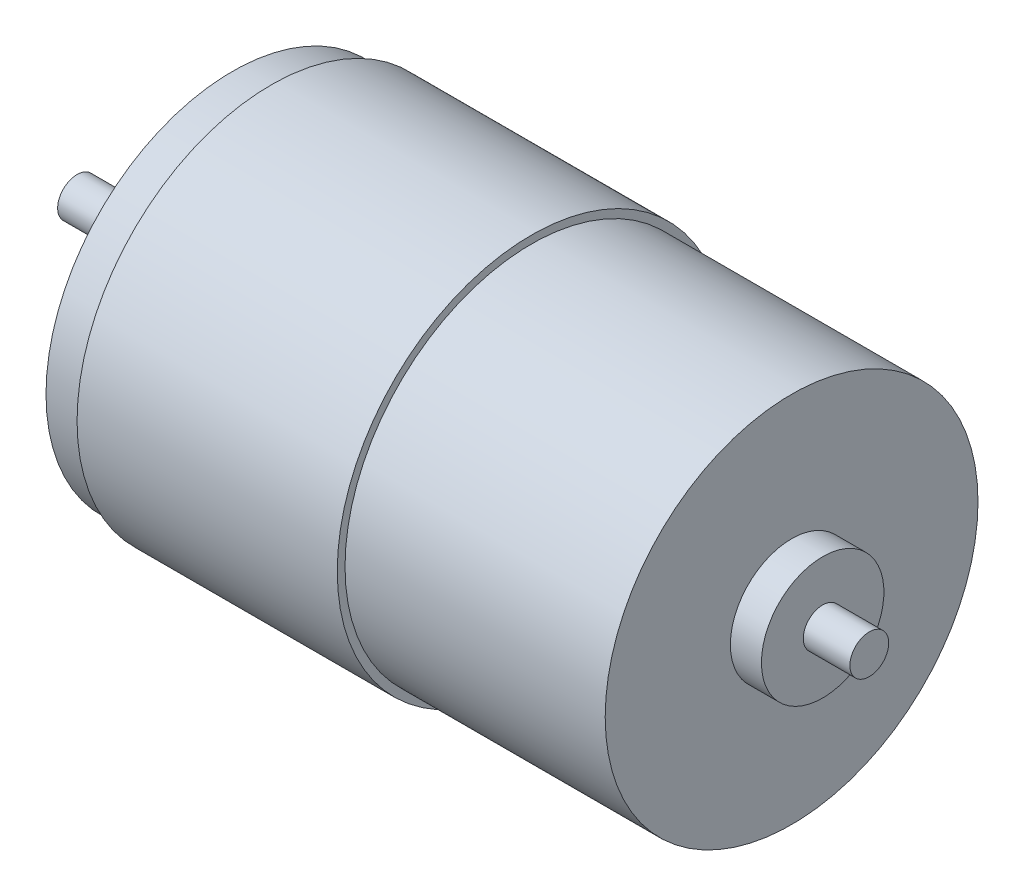
ISO-10303-21;
HEADER;
FILE_DESCRIPTION(('STEP AP214'),'2;1');
FILE_NAME('part.step','',(''),(''),'','','');
FILE_SCHEMA(('AUTOMOTIVE_DESIGN { 1 0 10303 214 1 1 1 1 }'));
ENDSEC;
DATA;
#1=APPLICATION_CONTEXT('core data for automotive mechanical design processes');
#2=APPLICATION_PROTOCOL_DEFINITION('international standard','automotive_design',2000,#1);
#3=PRODUCT_CONTEXT('',#1,'mechanical');
#4=PRODUCT('Part','Part','',(#3));
#5=PRODUCT_RELATED_PRODUCT_CATEGORY('part','',(#4));
#6=PRODUCT_DEFINITION_FORMATION('','',#4);
#7=PRODUCT_DEFINITION_CONTEXT('part definition',#1,'design');
#8=PRODUCT_DEFINITION('design','',#6,#7);
#9=PRODUCT_DEFINITION_SHAPE('','',#8);
#10=(LENGTH_UNIT() NAMED_UNIT(*) SI_UNIT(.MILLI.,.METRE.));
#11=(NAMED_UNIT(*) PLANE_ANGLE_UNIT() SI_UNIT($,.RADIAN.));
#12=(NAMED_UNIT(*) SI_UNIT($,.STERADIAN.) SOLID_ANGLE_UNIT());
#13=UNCERTAINTY_MEASURE_WITH_UNIT(LENGTH_MEASURE(1.E-05),#10,'distance_accuracy_value','');
#14=(GEOMETRIC_REPRESENTATION_CONTEXT(3) GLOBAL_UNCERTAINTY_ASSIGNED_CONTEXT((#13)) GLOBAL_UNIT_ASSIGNED_CONTEXT((#10,
#11,#12)) REPRESENTATION_CONTEXT('',''));
#15=CARTESIAN_POINT('',(0.,0.,0.));
#16=DIRECTION('',(0.,0.,1.));
#17=DIRECTION('',(1.,0.,0.));
#18=AXIS2_PLACEMENT_3D('',#15,#16,#17);
#19=CARTESIAN_POINT('',(-8.12353797841613,0.,0.));
#20=DIRECTION('',(-1.,0.,0.));
#21=DIRECTION('',(0.,0.,1.));
#22=AXIS2_PLACEMENT_3D('',#19,#20,#21);
#23=CYLINDRICAL_SURFACE('',#22,7.88455590960946);
#24=CARTESIAN_POINT('',(89.256074307646,0.,0.));
#25=DIRECTION('',(-1.,0.,0.));
#26=DIRECTION('',(0.,0.,1.));
#27=AXIS2_PLACEMENT_3D('',#24,#25,#26);
#28=CIRCLE('',#27,7.88455590960946);
#29=CARTESIAN_POINT('',(89.256074307646,0.,7.88455590960946));
#30=VERTEX_POINT('',#29);
#31=EDGE_CURVE('E82',#30,#30,#28,.T.);
#32=ORIENTED_EDGE('',*,*,#31,.T.);
#33=EDGE_LOOP('',(#32));
#34=FACE_BOUND('',#33,.T.);
#35=CARTESIAN_POINT('',(85.2560743076459,0.,0.));
#36=DIRECTION('',(-1.,0.,0.));
#37=DIRECTION('',(0.,0.,1.));
#38=AXIS2_PLACEMENT_3D('',#35,#36,#37);
#39=CIRCLE('',#38,7.88455590960946);
#40=CARTESIAN_POINT('',(85.2560743076459,0.,7.88455590960946));
#41=VERTEX_POINT('',#40);
#42=EDGE_CURVE('E10',#41,#41,#39,.T.);
#43=ORIENTED_EDGE('',*,*,#42,.F.);
#44=EDGE_LOOP('',(#43));
#45=FACE_BOUND('',#44,.T.);
#46=ADVANCED_FACE('F36',(#34,#45),#23,.T.);
#47=CARTESIAN_POINT('',(85.2560743076459,0.,0.));
#48=DIRECTION('',(1.,0.,0.));
#49=DIRECTION('',(0.,0.,-1.));
#50=AXIS2_PLACEMENT_3D('',#47,#48,#49);
#51=PLANE('',#50);
#52=ORIENTED_EDGE('',*,*,#42,.T.);
#53=EDGE_LOOP('',(#52));
#54=FACE_BOUND('',#53,.T.);
#55=CARTESIAN_POINT('',(85.2560743076459,0.,0.));
#56=DIRECTION('',(-1.,0.,0.));
#57=DIRECTION('',(0.,0.,1.));
#58=AXIS2_PLACEMENT_3D('',#55,#56,#57);
#59=CIRCLE('',#58,24.);
#60=CARTESIAN_POINT('',(85.2560743076459,0.,24.));
#61=VERTEX_POINT('',#60);
#62=EDGE_CURVE('E42',#61,#61,#59,.T.);
#63=ORIENTED_EDGE('',*,*,#62,.F.);
#64=EDGE_LOOP('',(#63));
#65=FACE_BOUND('',#64,.T.);
#66=ADVANCED_FACE('F146',(#54,#65),#51,.T.);
#67=CARTESIAN_POINT('',(-8.12353797841613,0.,0.));
#68=DIRECTION('',(-1.,0.,0.));
#69=DIRECTION('',(0.,0.,1.));
#70=AXIS2_PLACEMENT_3D('',#67,#68,#69);
#71=CYLINDRICAL_SURFACE('',#70,24.);
#72=ORIENTED_EDGE('',*,*,#62,.T.);
#73=EDGE_LOOP('',(#72));
#74=FACE_BOUND('',#73,.T.);
#75=CARTESIAN_POINT('',(51.7560743076459,0.,0.));
#76=DIRECTION('',(-1.,0.,0.));
#77=DIRECTION('',(0.,0.,1.));
#78=AXIS2_PLACEMENT_3D('',#75,#76,#77);
#79=CIRCLE('',#78,24.);
#80=CARTESIAN_POINT('',(51.7560743076459,0.,24.));
#81=VERTEX_POINT('',#80);
#82=EDGE_CURVE('E46',#81,#81,#79,.T.);
#83=ORIENTED_EDGE('',*,*,#82,.F.);
#84=EDGE_LOOP('',(#83));
#85=FACE_BOUND('',#84,.T.);
#86=ADVANCED_FACE('F151',(#74,#85),#71,.T.);
#87=CARTESIAN_POINT('',(51.7560743076459,0.,0.));
#88=DIRECTION('',(1.,0.,0.));
#89=DIRECTION('',(0.,0.,-1.));
#90=AXIS2_PLACEMENT_3D('',#87,#88,#89);
#91=PLANE('',#90);
#92=ORIENTED_EDGE('',*,*,#82,.T.);
#93=EDGE_LOOP('',(#92));
#94=FACE_BOUND('',#93,.T.);
#95=CARTESIAN_POINT('',(51.7560743076459,0.,0.));
#96=DIRECTION('',(-1.,0.,0.));
#97=DIRECTION('',(0.,0.,1.));
#98=AXIS2_PLACEMENT_3D('',#95,#96,#97);
#99=CIRCLE('',#98,25.);
#100=CARTESIAN_POINT('',(51.7560743076459,0.,25.));
#101=VERTEX_POINT('',#100);
#102=EDGE_CURVE('E50',#101,#101,#99,.T.);
#103=ORIENTED_EDGE('',*,*,#102,.F.);
#104=EDGE_LOOP('',(#103));
#105=FACE_BOUND('',#104,.T.);
#106=ADVANCED_FACE('F337',(#94,#105),#91,.T.);
#107=CARTESIAN_POINT('',(-8.12353797841613,0.,0.));
#108=DIRECTION('',(-1.,0.,0.));
#109=DIRECTION('',(0.,0.,1.));
#110=AXIS2_PLACEMENT_3D('',#107,#108,#109);
#111=CYLINDRICAL_SURFACE('',#110,25.);
#112=ORIENTED_EDGE('',*,*,#102,.T.);
#113=EDGE_LOOP('',(#112));
#114=FACE_BOUND('',#113,.T.);
#115=CARTESIAN_POINT('',(18.2560743076459,0.,0.));
#116=DIRECTION('',(-1.,0.,0.));
#117=DIRECTION('',(0.,0.,1.));
#118=AXIS2_PLACEMENT_3D('',#115,#116,#117);
#119=CIRCLE('',#118,25.);
#120=CARTESIAN_POINT('',(18.2560743076459,0.,25.));
#121=VERTEX_POINT('',#120);
#122=EDGE_CURVE('E55',#121,#121,#119,.T.);
#123=ORIENTED_EDGE('',*,*,#122,.F.);
#124=EDGE_LOOP('',(#123));
#125=FACE_BOUND('',#124,.T.);
#126=ADVANCED_FACE('F142',(#114,#125),#111,.T.);
#127=CARTESIAN_POINT('',(18.2560743076459,0.,0.));
#128=DIRECTION('',(1.,0.,0.));
#129=DIRECTION('',(0.,0.,-1.));
#130=AXIS2_PLACEMENT_3D('',#127,#128,#129);
#131=PLANE('',#130);
#132=CARTESIAN_POINT('',(18.2560743076459,0.,0.));
#133=DIRECTION('',(-1.,0.,0.));
#134=DIRECTION('',(0.,0.,1.));
#135=AXIS2_PLACEMENT_3D('',#132,#133,#134);
#136=CIRCLE('',#135,24.);
#137=CARTESIAN_POINT('',(18.2560743076459,0.,24.));
#138=VERTEX_POINT('',#137);
#139=EDGE_CURVE('E58',#138,#138,#136,.T.);
#140=ORIENTED_EDGE('',*,*,#139,.F.);
#141=EDGE_LOOP('',(#140));
#142=FACE_BOUND('',#141,.T.);
#143=ORIENTED_EDGE('',*,*,#122,.T.);
#144=EDGE_LOOP('',(#143));
#145=FACE_BOUND('',#144,.T.);
#146=ADVANCED_FACE('F136',(#142,#145),#131,.F.);
#147=CARTESIAN_POINT('',(-8.12353797841613,0.,0.));
#148=DIRECTION('',(-1.,0.,0.));
#149=DIRECTION('',(0.,0.,1.));
#150=AXIS2_PLACEMENT_3D('',#147,#148,#149);
#151=CYLINDRICAL_SURFACE('',#150,24.);
#152=ORIENTED_EDGE('',*,*,#139,.T.);
#153=EDGE_LOOP('',(#152));
#154=FACE_BOUND('',#153,.T.);
#155=CARTESIAN_POINT('',(13.2560743076459,0.,0.));
#156=DIRECTION('',(-1.,0.,0.));
#157=DIRECTION('',(0.,0.,1.));
#158=AXIS2_PLACEMENT_3D('',#155,#156,#157);
#159=CIRCLE('',#158,24.);
#160=CARTESIAN_POINT('',(13.2560743076459,0.,24.));
#161=VERTEX_POINT('',#160);
#162=EDGE_CURVE('E61',#161,#161,#159,.T.);
#163=ORIENTED_EDGE('',*,*,#162,.F.);
#164=EDGE_LOOP('',(#163));
#165=FACE_BOUND('',#164,.T.);
#166=ADVANCED_FACE('F123',(#154,#165),#151,.T.);
#167=CARTESIAN_POINT('',(13.2560743076459,0.,0.));
#168=DIRECTION('',(1.,0.,0.));
#169=DIRECTION('',(0.,0.,-1.));
#170=AXIS2_PLACEMENT_3D('',#167,#168,#169);
#171=PLANE('',#170);
#172=CARTESIAN_POINT('',(13.2560743076459,14.5,0.));
#173=DIRECTION('',(-1.,0.,0.));
#174=DIRECTION('',(0.,0.,1.));
#175=AXIS2_PLACEMENT_3D('',#172,#173,#174);
#176=CIRCLE('',#175,2.);
#177=CARTESIAN_POINT('',(13.2560743076459,14.5,2.));
#178=VERTEX_POINT('',#177);
#179=EDGE_CURVE('E104',#178,#178,#176,.T.);
#180=ORIENTED_EDGE('',*,*,#179,.F.);
#181=EDGE_LOOP('',(#180));
#182=FACE_BOUND('',#181,.T.);
#183=CARTESIAN_POINT('',(13.2560743076459,-14.5,0.));
#184=DIRECTION('',(-1.,0.,0.));
#185=DIRECTION('',(0.,0.,-1.));
#186=AXIS2_PLACEMENT_3D('',#183,#184,#185);
#187=CIRCLE('',#186,2.);
#188=CARTESIAN_POINT('',(13.2560743076459,-14.5,-2.));
#189=VERTEX_POINT('',#188);
#190=EDGE_CURVE('E98',#189,#189,#187,.T.);
#191=ORIENTED_EDGE('',*,*,#190,.F.);
#192=EDGE_LOOP('',(#191));
#193=FACE_BOUND('',#192,.T.);
#194=CARTESIAN_POINT('',(13.2560743076459,0.,-16.));
#195=DIRECTION('',(-1.,0.,0.));
#196=DIRECTION('',(0.,0.,1.));
#197=AXIS2_PLACEMENT_3D('',#194,#195,#196);
#198=CIRCLE('',#197,2.5);
#199=CARTESIAN_POINT('',(13.2560743076459,0.,-13.5));
#200=VERTEX_POINT('',#199);
#201=EDGE_CURVE('E92',#200,#200,#198,.T.);
#202=ORIENTED_EDGE('',*,*,#201,.F.);
#203=EDGE_LOOP('',(#202));
#204=FACE_BOUND('',#203,.T.);
#205=CARTESIAN_POINT('',(13.2560743076459,0.,16.));
#206=DIRECTION('',(-1.,0.,0.));
#207=DIRECTION('',(0.,0.,-1.));
#208=AXIS2_PLACEMENT_3D('',#205,#206,#207);
#209=CIRCLE('',#208,2.5);
#210=CARTESIAN_POINT('',(13.2560743076459,0.,13.5));
#211=VERTEX_POINT('',#210);
#212=EDGE_CURVE('E86',#211,#211,#209,.T.);
#213=ORIENTED_EDGE('',*,*,#212,.F.);
#214=EDGE_LOOP('',(#213));
#215=FACE_BOUND('',#214,.T.);
#216=CARTESIAN_POINT('',(13.2560743076459,0.,0.));
#217=DIRECTION('',(-1.,0.,0.));
#218=DIRECTION('',(0.,0.,1.));
#219=AXIS2_PLACEMENT_3D('',#216,#217,#218);
#220=CIRCLE('',#219,9.);
#221=CARTESIAN_POINT('',(13.2560743076459,0.,9.));
#222=VERTEX_POINT('',#221);
#223=EDGE_CURVE('E64',#222,#222,#220,.T.);
#224=ORIENTED_EDGE('',*,*,#223,.F.);
#225=EDGE_LOOP('',(#224));
#226=FACE_BOUND('',#225,.T.);
#227=ORIENTED_EDGE('',*,*,#162,.T.);
#228=EDGE_LOOP('',(#227));
#229=FACE_BOUND('',#228,.T.);
#230=ADVANCED_FACE('F119',(#182,#193,#204,#215,#226,#229),#171,.F.);
#231=CARTESIAN_POINT('',(-8.12353797841613,0.,0.));
#232=DIRECTION('',(-1.,0.,0.));
#233=DIRECTION('',(0.,0.,1.));
#234=AXIS2_PLACEMENT_3D('',#231,#232,#233);
#235=CYLINDRICAL_SURFACE('',#234,9.);
#236=ORIENTED_EDGE('',*,*,#223,.T.);
#237=EDGE_LOOP('',(#236));
#238=FACE_BOUND('',#237,.T.);
#239=CARTESIAN_POINT('',(9.25607430764594,0.,0.));
#240=DIRECTION('',(-1.,0.,0.));
#241=DIRECTION('',(0.,0.,1.));
#242=AXIS2_PLACEMENT_3D('',#239,#240,#241);
#243=CIRCLE('',#242,9.);
#244=CARTESIAN_POINT('',(9.25607430764594,0.,9.));
#245=VERTEX_POINT('',#244);
#246=EDGE_CURVE('E67',#245,#245,#243,.T.);
#247=ORIENTED_EDGE('',*,*,#246,.F.);
#248=EDGE_LOOP('',(#247));
#249=FACE_BOUND('',#248,.T.);
#250=ADVANCED_FACE('F122',(#238,#249),#235,.T.);
#251=CARTESIAN_POINT('',(9.25607430764594,0.,0.));
#252=DIRECTION('',(1.,0.,0.));
#253=DIRECTION('',(0.,0.,-1.));
#254=AXIS2_PLACEMENT_3D('',#251,#252,#253);
#255=PLANE('',#254);
#256=CARTESIAN_POINT('',(9.25607430764594,0.,0.));
#257=DIRECTION('',(-1.,0.,0.));
#258=DIRECTION('',(0.,0.,1.));
#259=AXIS2_PLACEMENT_3D('',#256,#257,#258);
#260=CIRCLE('',#259,2.5);
#261=CARTESIAN_POINT('',(9.25607430764594,0.,2.5));
#262=VERTEX_POINT('',#261);
#263=EDGE_CURVE('E70',#262,#262,#260,.T.);
#264=ORIENTED_EDGE('',*,*,#263,.F.);
#265=EDGE_LOOP('',(#264));
#266=FACE_BOUND('',#265,.T.);
#267=ORIENTED_EDGE('',*,*,#246,.T.);
#268=EDGE_LOOP('',(#267));
#269=FACE_BOUND('',#268,.T.);
#270=ADVANCED_FACE('F183',(#266,#269),#255,.F.);
#271=CARTESIAN_POINT('',(-8.12353797841613,0.,0.));
#272=DIRECTION('',(-1.,0.,0.));
#273=DIRECTION('',(0.,0.,1.));
#274=AXIS2_PLACEMENT_3D('',#271,#272,#273);
#275=CYLINDRICAL_SURFACE('',#274,2.5);
#276=ORIENTED_EDGE('',*,*,#263,.T.);
#277=EDGE_LOOP('',(#276));
#278=FACE_BOUND('',#277,.T.);
#279=CARTESIAN_POINT('',(-6.74392569235406,0.,0.));
#280=DIRECTION('',(-1.,0.,0.));
#281=DIRECTION('',(0.,0.,1.));
#282=AXIS2_PLACEMENT_3D('',#279,#280,#281);
#283=CIRCLE('',#282,2.5);
#284=CARTESIAN_POINT('',(-6.74392569235406,0.,2.5));
#285=VERTEX_POINT('',#284);
#286=EDGE_CURVE('E73',#285,#285,#283,.T.);
#287=ORIENTED_EDGE('',*,*,#286,.F.);
#288=EDGE_LOOP('',(#287));
#289=FACE_BOUND('',#288,.T.);
#290=ADVANCED_FACE('F179',(#278,#289),#275,.T.);
#291=CARTESIAN_POINT('',(-6.74392569235406,0.,0.));
#292=DIRECTION('',(-1.,0.,0.));
#293=DIRECTION('',(0.,0.,1.));
#294=AXIS2_PLACEMENT_3D('',#291,#292,#293);
#295=PLANE('',#294);
#296=ORIENTED_EDGE('',*,*,#286,.T.);
#297=EDGE_LOOP('',(#296));
#298=FACE_BOUND('',#297,.T.);
#299=ADVANCED_FACE('F175',(#298),#295,.T.);
#300=CARTESIAN_POINT('',(95.256074307646,0.,0.));
#301=DIRECTION('',(1.,0.,0.));
#302=DIRECTION('',(0.,0.,-1.));
#303=AXIS2_PLACEMENT_3D('',#300,#301,#302);
#304=PLANE('',#303);
#305=CARTESIAN_POINT('',(95.256074307646,0.,0.));
#306=DIRECTION('',(-1.,0.,0.));
#307=DIRECTION('',(0.,0.,1.));
#308=AXIS2_PLACEMENT_3D('',#305,#306,#307);
#309=CIRCLE('',#308,2.5);
#310=CARTESIAN_POINT('',(95.256074307646,0.,2.5));
#311=VERTEX_POINT('',#310);
#312=EDGE_CURVE('E76',#311,#311,#309,.T.);
#313=ORIENTED_EDGE('',*,*,#312,.F.);
#314=EDGE_LOOP('',(#313));
#315=FACE_BOUND('',#314,.T.);
#316=ADVANCED_FACE('F168',(#315),#304,.T.);
#317=CARTESIAN_POINT('',(-8.12353797841613,0.,0.));
#318=DIRECTION('',(-1.,0.,0.));
#319=DIRECTION('',(0.,0.,1.));
#320=AXIS2_PLACEMENT_3D('',#317,#318,#319);
#321=CYLINDRICAL_SURFACE('',#320,2.5);
#322=ORIENTED_EDGE('',*,*,#312,.T.);
#323=EDGE_LOOP('',(#322));
#324=FACE_BOUND('',#323,.T.);
#325=CARTESIAN_POINT('',(89.256074307646,0.,0.));
#326=DIRECTION('',(-1.,0.,0.));
#327=DIRECTION('',(0.,0.,1.));
#328=AXIS2_PLACEMENT_3D('',#325,#326,#327);
#329=CIRCLE('',#328,2.5);
#330=CARTESIAN_POINT('',(89.256074307646,0.,2.5));
#331=VERTEX_POINT('',#330);
#332=EDGE_CURVE('E79',#331,#331,#329,.T.);
#333=ORIENTED_EDGE('',*,*,#332,.F.);
#334=EDGE_LOOP('',(#333));
#335=FACE_BOUND('',#334,.T.);
#336=ADVANCED_FACE('F158',(#324,#335),#321,.T.);
#337=CARTESIAN_POINT('',(89.256074307646,0.,0.));
#338=DIRECTION('',(1.,0.,0.));
#339=DIRECTION('',(0.,0.,-1.));
#340=AXIS2_PLACEMENT_3D('',#337,#338,#339);
#341=PLANE('',#340);
#342=ORIENTED_EDGE('',*,*,#332,.T.);
#343=EDGE_LOOP('',(#342));
#344=FACE_BOUND('',#343,.T.);
#345=ORIENTED_EDGE('',*,*,#31,.F.);
#346=EDGE_LOOP('',(#345));
#347=FACE_BOUND('',#346,.T.);
#348=ADVANCED_FACE('F155',(#344,#347),#341,.T.);
#349=CARTESIAN_POINT('',(15.2560743076459,0.,16.));
#350=DIRECTION('',(-1.,0.,0.));
#351=DIRECTION('',(0.,0.,1.));
#352=AXIS2_PLACEMENT_3D('',#349,#350,#351);
#353=CYLINDRICAL_SURFACE('',#352,2.5);
#354=CARTESIAN_POINT('',(15.2560743076459,0.,16.));
#355=DIRECTION('',(-1.,0.,0.));
#356=DIRECTION('',(0.,0.,-1.));
#357=AXIS2_PLACEMENT_3D('',#354,#355,#356);
#358=CIRCLE('',#357,2.5);
#359=CARTESIAN_POINT('',(15.2560743076459,0.,13.5));
#360=VERTEX_POINT('',#359);
#361=EDGE_CURVE('E89',#360,#360,#358,.T.);
#362=ORIENTED_EDGE('',*,*,#361,.F.);
#363=EDGE_LOOP('',(#362));
#364=FACE_BOUND('',#363,.T.);
#365=ORIENTED_EDGE('',*,*,#212,.T.);
#366=EDGE_LOOP('',(#365));
#367=FACE_BOUND('',#366,.T.);
#368=ADVANCED_FACE('F157',(#364,#367),#353,.F.);
#369=CARTESIAN_POINT('',(15.2560743076459,0.,16.));
#370=DIRECTION('',(1.,0.,0.));
#371=DIRECTION('',(0.,0.,-1.));
#372=AXIS2_PLACEMENT_3D('',#369,#370,#371);
#373=PLANE('',#372);
#374=ORIENTED_EDGE('',*,*,#361,.T.);
#375=EDGE_LOOP('',(#374));
#376=FACE_BOUND('',#375,.T.);
#377=ADVANCED_FACE('F165',(#376),#373,.F.);
#378=CARTESIAN_POINT('',(15.2560743076459,0.,-16.));
#379=DIRECTION('',(-1.,0.,0.));
#380=DIRECTION('',(0.,0.,1.));
#381=AXIS2_PLACEMENT_3D('',#378,#379,#380);
#382=CYLINDRICAL_SURFACE('',#381,2.5);
#383=CARTESIAN_POINT('',(15.2560743076459,0.,-16.));
#384=DIRECTION('',(-1.,0.,0.));
#385=DIRECTION('',(0.,0.,1.));
#386=AXIS2_PLACEMENT_3D('',#383,#384,#385);
#387=CIRCLE('',#386,2.5);
#388=CARTESIAN_POINT('',(15.2560743076459,0.,-13.5));
#389=VERTEX_POINT('',#388);
#390=EDGE_CURVE('E95',#389,#389,#387,.T.);
#391=ORIENTED_EDGE('',*,*,#390,.F.);
#392=EDGE_LOOP('',(#391));
#393=FACE_BOUND('',#392,.T.);
#394=ORIENTED_EDGE('',*,*,#201,.T.);
#395=EDGE_LOOP('',(#394));
#396=FACE_BOUND('',#395,.T.);
#397=ADVANCED_FACE('F242',(#393,#396),#382,.F.);
#398=CARTESIAN_POINT('',(15.2560743076459,0.,-16.));
#399=DIRECTION('',(-1.,0.,0.));
#400=DIRECTION('',(0.,0.,1.));
#401=AXIS2_PLACEMENT_3D('',#398,#399,#400);
#402=PLANE('',#401);
#403=ORIENTED_EDGE('',*,*,#390,.T.);
#404=EDGE_LOOP('',(#403));
#405=FACE_BOUND('',#404,.T.);
#406=ADVANCED_FACE('F251',(#405),#402,.T.);
#407=CARTESIAN_POINT('',(15.2560743076459,-14.5,0.));
#408=DIRECTION('',(-1.,0.,0.));
#409=DIRECTION('',(0.,0.,1.));
#410=AXIS2_PLACEMENT_3D('',#407,#408,#409);
#411=CYLINDRICAL_SURFACE('',#410,2.);
#412=CARTESIAN_POINT('',(15.2560743076459,-14.5,0.));
#413=DIRECTION('',(-1.,0.,0.));
#414=DIRECTION('',(0.,0.,-1.));
#415=AXIS2_PLACEMENT_3D('',#412,#413,#414);
#416=CIRCLE('',#415,2.);
#417=CARTESIAN_POINT('',(15.2560743076459,-14.5,-2.));
#418=VERTEX_POINT('',#417);
#419=EDGE_CURVE('E101',#418,#418,#416,.T.);
#420=ORIENTED_EDGE('',*,*,#419,.F.);
#421=EDGE_LOOP('',(#420));
#422=FACE_BOUND('',#421,.T.);
#423=ORIENTED_EDGE('',*,*,#190,.T.);
#424=EDGE_LOOP('',(#423));
#425=FACE_BOUND('',#424,.T.);
#426=ADVANCED_FACE('F261',(#422,#425),#411,.F.);
#427=CARTESIAN_POINT('',(15.2560743076459,-14.5,0.));
#428=DIRECTION('',(1.,0.,0.));
#429=DIRECTION('',(0.,0.,-1.));
#430=AXIS2_PLACEMENT_3D('',#427,#428,#429);
#431=PLANE('',#430);
#432=ORIENTED_EDGE('',*,*,#419,.T.);
#433=EDGE_LOOP('',(#432));
#434=FACE_BOUND('',#433,.T.);
#435=ADVANCED_FACE('F115',(#434),#431,.F.);
#436=CARTESIAN_POINT('',(15.2560743076459,14.5,0.));
#437=DIRECTION('',(-1.,0.,0.));
#438=DIRECTION('',(0.,0.,1.));
#439=AXIS2_PLACEMENT_3D('',#436,#437,#438);
#440=CYLINDRICAL_SURFACE('',#439,2.);
#441=CARTESIAN_POINT('',(15.2560743076459,14.5,0.));
#442=DIRECTION('',(-1.,0.,0.));
#443=DIRECTION('',(0.,0.,1.));
#444=AXIS2_PLACEMENT_3D('',#441,#442,#443);
#445=CIRCLE('',#444,2.);
#446=CARTESIAN_POINT('',(15.2560743076459,14.5,2.));
#447=VERTEX_POINT('',#446);
#448=EDGE_CURVE('E85',#447,#447,#445,.T.);
#449=ORIENTED_EDGE('',*,*,#448,.F.);
#450=EDGE_LOOP('',(#449));
#451=FACE_BOUND('',#450,.T.);
#452=ORIENTED_EDGE('',*,*,#179,.T.);
#453=EDGE_LOOP('',(#452));
#454=FACE_BOUND('',#453,.T.);
#455=ADVANCED_FACE('F112',(#451,#454),#440,.F.);
#456=CARTESIAN_POINT('',(15.2560743076459,14.5,0.));
#457=DIRECTION('',(-1.,0.,0.));
#458=DIRECTION('',(0.,0.,1.));
#459=AXIS2_PLACEMENT_3D('',#456,#457,#458);
#460=PLANE('',#459);
#461=ORIENTED_EDGE('',*,*,#448,.T.);
#462=EDGE_LOOP('',(#461));
#463=FACE_BOUND('',#462,.T.);
#464=ADVANCED_FACE('F110',(#463),#460,.T.);
#465=CLOSED_SHELL('',(#46,#66,#86,#106,#126,#146,#166,#230,#250,#270,#290,#299,#316,#336,#348,
#368,#377,#397,#406,#426,#435,#455,#464));
#466=MANIFOLD_SOLID_BREP('B2',#465);
#467=ADVANCED_BREP_SHAPE_REPRESENTATION('',(#18,#466),#14);
#468=SHAPE_DEFINITION_REPRESENTATION(#9,#467);
ENDSEC;
END-ISO-10303-21;
